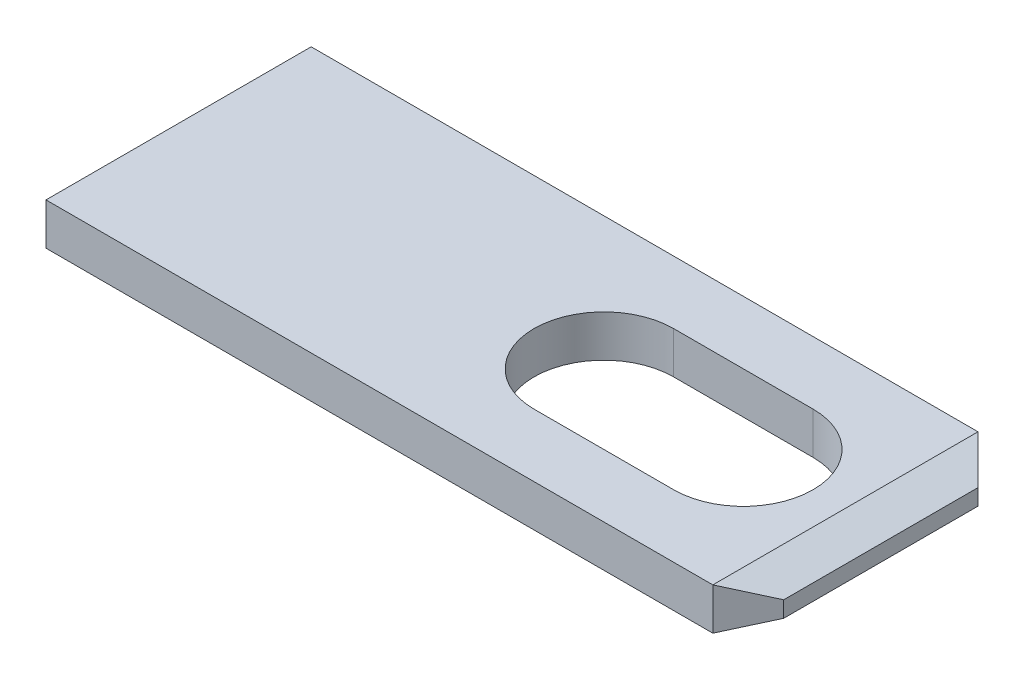
ISO-10303-21;
HEADER;
FILE_DESCRIPTION(('STEP AP214'),'2;1');
FILE_NAME('part.step','',(''),(''),'','','');
FILE_SCHEMA(('AUTOMOTIVE_DESIGN { 1 0 10303 214 1 1 1 1 }'));
ENDSEC;
DATA;
#1=APPLICATION_CONTEXT('core data for automotive mechanical design processes');
#2=APPLICATION_PROTOCOL_DEFINITION('international standard','automotive_design',2000,#1);
#3=PRODUCT_CONTEXT('',#1,'mechanical');
#4=PRODUCT('Part','Part','',(#3));
#5=PRODUCT_RELATED_PRODUCT_CATEGORY('part','',(#4));
#6=PRODUCT_DEFINITION_FORMATION('','',#4);
#7=PRODUCT_DEFINITION_CONTEXT('part definition',#1,'design');
#8=PRODUCT_DEFINITION('design','',#6,#7);
#9=PRODUCT_DEFINITION_SHAPE('','',#8);
#10=(LENGTH_UNIT() NAMED_UNIT(*) SI_UNIT(.MILLI.,.METRE.));
#11=(NAMED_UNIT(*) PLANE_ANGLE_UNIT() SI_UNIT($,.RADIAN.));
#12=(NAMED_UNIT(*) SI_UNIT($,.STERADIAN.) SOLID_ANGLE_UNIT());
#13=UNCERTAINTY_MEASURE_WITH_UNIT(LENGTH_MEASURE(1.E-05),#10,'distance_accuracy_value','');
#14=(GEOMETRIC_REPRESENTATION_CONTEXT(3) GLOBAL_UNCERTAINTY_ASSIGNED_CONTEXT((#13)) GLOBAL_UNIT_ASSIGNED_CONTEXT((#10,
#11,#12)) REPRESENTATION_CONTEXT('',''));
#15=CARTESIAN_POINT('',(0.,0.,0.));
#16=DIRECTION('',(0.,0.,1.));
#17=DIRECTION('',(1.,0.,0.));
#18=AXIS2_PLACEMENT_3D('',#15,#16,#17);
#19=CARTESIAN_POINT('',(10.063988,-0.115103120992769,1.89999999999998));
#20=DIRECTION('',(0.342020143325666,-0.939692620785909,0.));
#21=DIRECTION('',(0.939692620785909,0.342020143325666,0.));
#22=AXIS2_PLACEMENT_3D('',#19,#20,#21);
#23=PLANE('',#22);
#24=DIRECTION('',(-0.684791078771737,-0.249243569363954,-0.684791078771735));
#25=VECTOR('',#24,1.);
#26=CARTESIAN_POINT('',(10.063988,-0.115103120992769,-1.39200000000001));
#27=LINE('',#26,#25);
#28=CARTESIAN_POINT('',(10.063988,-0.115103120992769,-1.39200000000001));
#29=VERTEX_POINT('',#28);
#30=CARTESIAN_POINT('',(9.555988,-0.299999999999999,-1.90000000000001));
#31=VERTEX_POINT('',#30);
#32=EDGE_CURVE('E118',#29,#31,#27,.T.);
#33=ORIENTED_EDGE('',*,*,#32,.F.);
#34=DIRECTION('',(0.,0.,-1.));
#35=VECTOR('',#34,1.);
#36=CARTESIAN_POINT('',(10.063988,-0.115103120992769,1.89999999999998));
#37=LINE('',#36,#35);
#38=CARTESIAN_POINT('',(10.063988,-0.115103120992769,1.39199999999999));
#39=VERTEX_POINT('',#38);
#40=EDGE_CURVE('E142',#39,#29,#37,.T.);
#41=ORIENTED_EDGE('',*,*,#40,.F.);
#42=DIRECTION('',(0.684791078771737,0.249243569363954,-0.684791078771735));
#43=VECTOR('',#42,1.);
#44=CARTESIAN_POINT('',(9.555988,-0.3,1.89999999999999));
#45=LINE('',#44,#43);
#46=CARTESIAN_POINT('',(9.555988,-0.3,1.89999999999999));
#47=VERTEX_POINT('',#46);
#48=EDGE_CURVE('E139',#47,#39,#45,.T.);
#49=ORIENTED_EDGE('',*,*,#48,.F.);
#50=DIRECTION('',(0.,0.,1.));
#51=VECTOR('',#50,1.);
#52=CARTESIAN_POINT('',(9.555988,-0.3,-1.90000000000001));
#53=LINE('',#52,#51);
#54=EDGE_CURVE('E100',#47,#31,#53,.F.);
#55=ORIENTED_EDGE('',*,*,#54,.T.);
#56=EDGE_LOOP('',(#33,#41,#49,#55));
#57=FACE_BOUND('',#56,.T.);
#58=ADVANCED_FACE('F16',(#57),#23,.T.);
#59=CARTESIAN_POINT('',(10.063988,0.299999999999999,-1.39200000000001));
#60=DIRECTION('',(0.707106781186546,0.,-0.707106781186549));
#61=DIRECTION('',(-0.707106781186549,0.,-0.707106781186546));
#62=AXIS2_PLACEMENT_3D('',#59,#60,#61);
#63=PLANE('',#62);
#64=DIRECTION('',(0.,1.,0.));
#65=VECTOR('',#64,1.);
#66=CARTESIAN_POINT('',(9.555988,-0.3,-1.90000000000001));
#67=LINE('',#66,#65);
#68=CARTESIAN_POINT('',(9.555988,0.3,-1.90000000000001));
#69=VERTEX_POINT('',#68);
#70=EDGE_CURVE('E153',#31,#69,#67,.T.);
#71=ORIENTED_EDGE('',*,*,#70,.T.);
#72=DIRECTION('',(-0.684791078771737,0.249243569363953,-0.684791078771735));
#73=VECTOR('',#72,1.);
#74=CARTESIAN_POINT('',(10.063988,0.115103120992769,-1.39200000000001));
#75=LINE('',#74,#73);
#76=CARTESIAN_POINT('',(10.063988,0.115103120992769,-1.39200000000001));
#77=VERTEX_POINT('',#76);
#78=EDGE_CURVE('E168',#77,#69,#75,.T.);
#79=ORIENTED_EDGE('',*,*,#78,.F.);
#80=DIRECTION('',(0.,1.,0.));
#81=VECTOR('',#80,1.);
#82=CARTESIAN_POINT('',(10.063988,0.299999999999999,-1.39200000000001));
#83=LINE('',#82,#81);
#84=EDGE_CURVE('E141',#29,#77,#83,.T.);
#85=ORIENTED_EDGE('',*,*,#84,.F.);
#86=ORIENTED_EDGE('',*,*,#32,.T.);
#87=EDGE_LOOP('',(#71,#79,#85,#86));
#88=FACE_BOUND('',#87,.T.);
#89=ADVANCED_FACE('F150',(#88),#63,.T.);
#90=CARTESIAN_POINT('',(10.063988,0.299999999999999,1.89999999999998));
#91=DIRECTION('',(1.,0.,0.));
#92=DIRECTION('',(0.,0.,-1.));
#93=AXIS2_PLACEMENT_3D('',#90,#91,#92);
#94=PLANE('',#93);
#95=ORIENTED_EDGE('',*,*,#84,.T.);
#96=DIRECTION('',(0.,0.,1.));
#97=VECTOR('',#96,1.);
#98=CARTESIAN_POINT('',(10.063988,0.115103120992768,1.89999999999998));
#99=LINE('',#98,#97);
#100=CARTESIAN_POINT('',(10.063988,0.115103120992769,1.39199999999999));
#101=VERTEX_POINT('',#100);
#102=EDGE_CURVE('E179',#101,#77,#99,.F.);
#103=ORIENTED_EDGE('',*,*,#102,.F.);
#104=DIRECTION('',(0.,1.,0.));
#105=VECTOR('',#104,1.);
#106=CARTESIAN_POINT('',(10.063988,0.299999999999999,1.39199999999999));
#107=LINE('',#106,#105);
#108=EDGE_CURVE('E137',#39,#101,#107,.T.);
#109=ORIENTED_EDGE('',*,*,#108,.F.);
#110=ORIENTED_EDGE('',*,*,#40,.T.);
#111=EDGE_LOOP('',(#95,#103,#109,#110));
#112=FACE_BOUND('',#111,.T.);
#113=ADVANCED_FACE('F298',(#112),#94,.T.);
#114=CARTESIAN_POINT('',(10.063988,0.299999999999999,1.39199999999999));
#115=DIRECTION('',(0.707106781186546,0.,0.707106781186549));
#116=DIRECTION('',(0.707106781186549,0.,-0.707106781186546));
#117=AXIS2_PLACEMENT_3D('',#114,#115,#116);
#118=PLANE('',#117);
#119=ORIENTED_EDGE('',*,*,#108,.T.);
#120=DIRECTION('',(0.684791078771738,-0.249243569363953,-0.684791078771735));
#121=VECTOR('',#120,1.);
#122=CARTESIAN_POINT('',(9.555988,0.299999999999998,1.89999999999998));
#123=LINE('',#122,#121);
#124=CARTESIAN_POINT('',(9.555988,0.299999999999999,1.89999999999999));
#125=VERTEX_POINT('',#124);
#126=EDGE_CURVE('E176',#125,#101,#123,.T.);
#127=ORIENTED_EDGE('',*,*,#126,.F.);
#128=DIRECTION('',(0.,1.,0.));
#129=VECTOR('',#128,1.);
#130=CARTESIAN_POINT('',(9.555988,-0.3,1.89999999999998));
#131=LINE('',#130,#129);
#132=EDGE_CURVE('E33',#125,#47,#131,.F.);
#133=ORIENTED_EDGE('',*,*,#132,.T.);
#134=ORIENTED_EDGE('',*,*,#48,.T.);
#135=EDGE_LOOP('',(#119,#127,#133,#134));
#136=FACE_BOUND('',#135,.T.);
#137=ADVANCED_FACE('F290',(#136),#118,.T.);
#138=CARTESIAN_POINT('',(10.063988,-0.3,-1.90000000000001));
#139=DIRECTION('',(0.,1.,0.));
#140=DIRECTION('',(0.,0.,1.));
#141=AXIS2_PLACEMENT_3D('',#138,#139,#140);
#142=PLANE('',#141);
#143=ORIENTED_EDGE('',*,*,#54,.F.);
#144=DIRECTION('',(-1.,0.,0.));
#145=VECTOR('',#144,1.);
#146=CARTESIAN_POINT('',(10.063988,-0.3,1.89999999999998));
#147=LINE('',#146,#145);
#148=CARTESIAN_POINT('',(0.,-0.3,1.89999999999999));
#149=VERTEX_POINT('',#148);
#150=EDGE_CURVE('E128',#47,#149,#147,.T.);
#151=ORIENTED_EDGE('',*,*,#150,.T.);
#152=DIRECTION('',(0.,0.,-1.));
#153=VECTOR('',#152,1.);
#154=CARTESIAN_POINT('',(0.,-0.3,1.89999999999998));
#155=LINE('',#154,#153);
#156=CARTESIAN_POINT('',(0.,-0.3,-1.90000000000001));
#157=VERTEX_POINT('',#156);
#158=EDGE_CURVE('E108',#149,#157,#155,.T.);
#159=ORIENTED_EDGE('',*,*,#158,.T.);
#160=DIRECTION('',(1.,0.,0.));
#161=VECTOR('',#160,1.);
#162=CARTESIAN_POINT('',(10.063988,-0.3,-1.90000000000001));
#163=LINE('',#162,#161);
#164=EDGE_CURVE('E164',#157,#31,#163,.T.);
#165=ORIENTED_EDGE('',*,*,#164,.T.);
#166=EDGE_LOOP('',(#143,#151,#159,#165));
#167=FACE_BOUND('',#166,.T.);
#168=CARTESIAN_POINT('',(6.09373158605447,-0.300000000000001,0.));
#169=DIRECTION('',(0.,1.,0.));
#170=DIRECTION('',(0.,0.,1.));
#171=AXIS2_PLACEMENT_3D('',#168,#169,#170);
#172=CIRCLE('',#171,1.);
#173=CARTESIAN_POINT('',(6.09373158605447,-0.300000000000001,-1.));
#174=VERTEX_POINT('',#173);
#175=CARTESIAN_POINT('',(6.09373158605447,-0.300000000000001,1.));
#176=VERTEX_POINT('',#175);
#177=EDGE_CURVE('E112',#174,#176,#172,.T.);
#178=ORIENTED_EDGE('',*,*,#177,.T.);
#179=DIRECTION('',(1.,0.,0.));
#180=VECTOR('',#179,1.);
#181=CARTESIAN_POINT('',(8.09373158605447,-0.300000000000001,1.));
#182=LINE('',#181,#180);
#183=CARTESIAN_POINT('',(8.09373158605447,-0.300000000000001,1.));
#184=VERTEX_POINT('',#183);
#185=EDGE_CURVE('E104',#176,#184,#182,.T.);
#186=ORIENTED_EDGE('',*,*,#185,.T.);
#187=CARTESIAN_POINT('',(8.09373158605447,-0.3,0.));
#188=DIRECTION('',(0.,1.,0.));
#189=DIRECTION('',(0.,0.,1.));
#190=AXIS2_PLACEMENT_3D('',#187,#188,#189);
#191=CIRCLE('',#190,1.);
#192=CARTESIAN_POINT('',(8.09373158605447,-0.3,-1.));
#193=VERTEX_POINT('',#192);
#194=EDGE_CURVE('E19',#184,#193,#191,.T.);
#195=ORIENTED_EDGE('',*,*,#194,.T.);
#196=DIRECTION('',(1.,0.,0.));
#197=VECTOR('',#196,1.);
#198=CARTESIAN_POINT('',(6.09373158605447,-0.300000000000001,-1.));
#199=LINE('',#198,#197);
#200=EDGE_CURVE('E120',#193,#174,#199,.F.);
#201=ORIENTED_EDGE('',*,*,#200,.T.);
#202=EDGE_LOOP('',(#178,#186,#195,#201));
#203=FACE_BOUND('',#202,.T.);
#204=ADVANCED_FACE('F110',(#167,#203),#142,.F.);
#205=CARTESIAN_POINT('',(8.09373158605447,-0.300000000000001,0.));
#206=DIRECTION('',(0.,1.,0.));
#207=DIRECTION('',(0.,0.,1.));
#208=AXIS2_PLACEMENT_3D('',#205,#206,#207);
#209=CYLINDRICAL_SURFACE('',#208,1.);
#210=DIRECTION('',(0.,1.,0.));
#211=VECTOR('',#210,1.);
#212=CARTESIAN_POINT('',(8.09373158605447,-0.300000000000001,-1.));
#213=LINE('',#212,#211);
#214=CARTESIAN_POINT('',(8.09373158605447,0.3,-1.));
#215=VERTEX_POINT('',#214);
#216=EDGE_CURVE('E96',#215,#193,#213,.F.);
#217=ORIENTED_EDGE('',*,*,#216,.T.);
#218=ORIENTED_EDGE('',*,*,#194,.F.);
#219=DIRECTION('',(0.,-1.,0.));
#220=VECTOR('',#219,1.);
#221=CARTESIAN_POINT('',(8.09373158605447,-0.300000000000001,1.));
#222=LINE('',#221,#220);
#223=CARTESIAN_POINT('',(8.09373158605447,0.3,1.));
#224=VERTEX_POINT('',#223);
#225=EDGE_CURVE('E94',#184,#224,#222,.F.);
#226=ORIENTED_EDGE('',*,*,#225,.T.);
#227=CARTESIAN_POINT('',(8.09373158605447,0.3,0.));
#228=DIRECTION('',(0.,1.,0.));
#229=DIRECTION('',(0.,0.,1.));
#230=AXIS2_PLACEMENT_3D('',#227,#228,#229);
#231=CIRCLE('',#230,1.);
#232=EDGE_CURVE('E127',#224,#215,#231,.T.);
#233=ORIENTED_EDGE('',*,*,#232,.T.);
#234=EDGE_LOOP('',(#217,#218,#226,#233));
#235=FACE_BOUND('',#234,.T.);
#236=ADVANCED_FACE('F92',(#235),#209,.F.);
#237=CARTESIAN_POINT('',(6.09373158605447,-0.300000000000001,-1.));
#238=DIRECTION('',(0.,0.,-1.));
#239=DIRECTION('',(0.,1.,0.));
#240=AXIS2_PLACEMENT_3D('',#237,#238,#239);
#241=PLANE('',#240);
#242=DIRECTION('',(0.,1.,0.));
#243=VECTOR('',#242,1.);
#244=CARTESIAN_POINT('',(6.09373158605447,-0.300000000000001,-1.));
#245=LINE('',#244,#243);
#246=CARTESIAN_POINT('',(6.09373158605447,0.3,-1.));
#247=VERTEX_POINT('',#246);
#248=EDGE_CURVE('E122',#247,#174,#245,.F.);
#249=ORIENTED_EDGE('',*,*,#248,.T.);
#250=ORIENTED_EDGE('',*,*,#200,.F.);
#251=ORIENTED_EDGE('',*,*,#216,.F.);
#252=DIRECTION('',(1.,0.,0.));
#253=VECTOR('',#252,1.);
#254=CARTESIAN_POINT('',(10.063988,0.3,-1.));
#255=LINE('',#254,#253);
#256=EDGE_CURVE('E126',#215,#247,#255,.F.);
#257=ORIENTED_EDGE('',*,*,#256,.T.);
#258=EDGE_LOOP('',(#249,#250,#251,#257));
#259=FACE_BOUND('',#258,.T.);
#260=ADVANCED_FACE('F267',(#259),#241,.F.);
#261=CARTESIAN_POINT('',(6.09373158605447,-0.300000000000001,0.));
#262=DIRECTION('',(0.,1.,0.));
#263=DIRECTION('',(0.,0.,1.));
#264=AXIS2_PLACEMENT_3D('',#261,#262,#263);
#265=CYLINDRICAL_SURFACE('',#264,1.);
#266=DIRECTION('',(0.,-1.,0.));
#267=VECTOR('',#266,1.);
#268=CARTESIAN_POINT('',(6.09373158605447,-0.300000000000001,1.));
#269=LINE('',#268,#267);
#270=CARTESIAN_POINT('',(6.09373158605447,0.3,1.));
#271=VERTEX_POINT('',#270);
#272=EDGE_CURVE('E113',#271,#176,#269,.T.);
#273=ORIENTED_EDGE('',*,*,#272,.T.);
#274=ORIENTED_EDGE('',*,*,#177,.F.);
#275=ORIENTED_EDGE('',*,*,#248,.F.);
#276=CARTESIAN_POINT('',(6.09373158605447,0.3,0.));
#277=DIRECTION('',(0.,1.,0.));
#278=DIRECTION('',(0.,0.,1.));
#279=AXIS2_PLACEMENT_3D('',#276,#277,#278);
#280=CIRCLE('',#279,1.);
#281=EDGE_CURVE('E123',#247,#271,#280,.T.);
#282=ORIENTED_EDGE('',*,*,#281,.T.);
#283=EDGE_LOOP('',(#273,#274,#275,#282));
#284=FACE_BOUND('',#283,.T.);
#285=ADVANCED_FACE('F213',(#284),#265,.F.);
#286=CARTESIAN_POINT('',(8.09373158605447,-0.300000000000001,1.));
#287=DIRECTION('',(0.,0.,1.));
#288=DIRECTION('',(0.,-1.,0.));
#289=AXIS2_PLACEMENT_3D('',#286,#287,#288);
#290=PLANE('',#289);
#291=ORIENTED_EDGE('',*,*,#225,.F.);
#292=ORIENTED_EDGE('',*,*,#185,.F.);
#293=ORIENTED_EDGE('',*,*,#272,.F.);
#294=DIRECTION('',(1.,0.,0.));
#295=VECTOR('',#294,1.);
#296=CARTESIAN_POINT('',(10.063988,0.3,1.));
#297=LINE('',#296,#295);
#298=EDGE_CURVE('E107',#271,#224,#297,.T.);
#299=ORIENTED_EDGE('',*,*,#298,.T.);
#300=EDGE_LOOP('',(#291,#292,#293,#299));
#301=FACE_BOUND('',#300,.T.);
#302=ADVANCED_FACE('F103',(#301),#290,.F.);
#303=CARTESIAN_POINT('',(0.,0.299999999999999,1.89999999999998));
#304=DIRECTION('',(1.,0.,0.));
#305=DIRECTION('',(0.,0.,-1.));
#306=AXIS2_PLACEMENT_3D('',#303,#304,#305);
#307=PLANE('',#306);
#308=DIRECTION('',(0.,0.,-1.));
#309=VECTOR('',#308,1.);
#310=CARTESIAN_POINT('',(0.,0.3,-1.90000000000001));
#311=LINE('',#310,#309);
#312=CARTESIAN_POINT('',(0.,0.3,1.89999999999999));
#313=VERTEX_POINT('',#312);
#314=CARTESIAN_POINT('',(0.,0.3,-1.90000000000001));
#315=VERTEX_POINT('',#314);
#316=EDGE_CURVE('E189',#313,#315,#311,.T.);
#317=ORIENTED_EDGE('',*,*,#316,.T.);
#318=DIRECTION('',(0.,1.,0.));
#319=VECTOR('',#318,1.);
#320=CARTESIAN_POINT('',(0.,-0.3,-1.90000000000001));
#321=LINE('',#320,#319);
#322=EDGE_CURVE('E170',#315,#157,#321,.F.);
#323=ORIENTED_EDGE('',*,*,#322,.T.);
#324=ORIENTED_EDGE('',*,*,#158,.F.);
#325=DIRECTION('',(0.,1.,0.));
#326=VECTOR('',#325,1.);
#327=CARTESIAN_POINT('',(0.,-0.3,1.89999999999998));
#328=LINE('',#327,#326);
#329=EDGE_CURVE('E182',#149,#313,#328,.T.);
#330=ORIENTED_EDGE('',*,*,#329,.T.);
#331=EDGE_LOOP('',(#317,#323,#324,#330));
#332=FACE_BOUND('',#331,.T.);
#333=ADVANCED_FACE('F204',(#332),#307,.F.);
#334=CARTESIAN_POINT('',(10.063988,-0.3,-1.90000000000001));
#335=DIRECTION('',(0.,0.,1.));
#336=DIRECTION('',(1.,0.,0.));
#337=AXIS2_PLACEMENT_3D('',#334,#335,#336);
#338=PLANE('',#337);
#339=ORIENTED_EDGE('',*,*,#70,.F.);
#340=ORIENTED_EDGE('',*,*,#164,.F.);
#341=ORIENTED_EDGE('',*,*,#322,.F.);
#342=DIRECTION('',(1.,0.,0.));
#343=VECTOR('',#342,1.);
#344=CARTESIAN_POINT('',(10.063988,0.3,-1.90000000000001));
#345=LINE('',#344,#343);
#346=EDGE_CURVE('E167',#315,#69,#345,.T.);
#347=ORIENTED_EDGE('',*,*,#346,.T.);
#348=EDGE_LOOP('',(#339,#340,#341,#347));
#349=FACE_BOUND('',#348,.T.);
#350=ADVANCED_FACE('F163',(#349),#338,.F.);
#351=CARTESIAN_POINT('',(10.063988,0.115103120992768,1.89999999999998));
#352=DIRECTION('',(0.342020143325666,0.939692620785909,0.));
#353=DIRECTION('',(-0.939692620785909,0.342020143325666,0.));
#354=AXIS2_PLACEMENT_3D('',#351,#352,#353);
#355=PLANE('',#354);
#356=ORIENTED_EDGE('',*,*,#126,.T.);
#357=ORIENTED_EDGE('',*,*,#102,.T.);
#358=ORIENTED_EDGE('',*,*,#78,.T.);
#359=DIRECTION('',(0.,0.,-1.));
#360=VECTOR('',#359,1.);
#361=CARTESIAN_POINT('',(9.555988,0.3,-1.90000000000001));
#362=LINE('',#361,#360);
#363=EDGE_CURVE('E25',#69,#125,#362,.F.);
#364=ORIENTED_EDGE('',*,*,#363,.T.);
#365=EDGE_LOOP('',(#356,#357,#358,#364));
#366=FACE_BOUND('',#365,.T.);
#367=ADVANCED_FACE('F195',(#366),#355,.T.);
#368=CARTESIAN_POINT('',(10.063988,-0.3,1.89999999999998));
#369=DIRECTION('',(0.,0.,-1.));
#370=DIRECTION('',(-1.,0.,0.));
#371=AXIS2_PLACEMENT_3D('',#368,#369,#370);
#372=PLANE('',#371);
#373=ORIENTED_EDGE('',*,*,#132,.F.);
#374=DIRECTION('',(1.,0.,0.));
#375=VECTOR('',#374,1.);
#376=CARTESIAN_POINT('',(10.063988,0.299999999999999,1.89999999999999));
#377=LINE('',#376,#375);
#378=EDGE_CURVE('E10',#125,#313,#377,.F.);
#379=ORIENTED_EDGE('',*,*,#378,.T.);
#380=ORIENTED_EDGE('',*,*,#329,.F.);
#381=ORIENTED_EDGE('',*,*,#150,.F.);
#382=EDGE_LOOP('',(#373,#379,#380,#381));
#383=FACE_BOUND('',#382,.T.);
#384=ADVANCED_FACE('F202',(#383),#372,.F.);
#385=CARTESIAN_POINT('',(10.063988,0.3,-1.90000000000001));
#386=DIRECTION('',(0.,-1.,0.));
#387=DIRECTION('',(0.,0.,-1.));
#388=AXIS2_PLACEMENT_3D('',#385,#386,#387);
#389=PLANE('',#388);
#390=ORIENTED_EDGE('',*,*,#363,.F.);
#391=ORIENTED_EDGE('',*,*,#346,.F.);
#392=ORIENTED_EDGE('',*,*,#316,.F.);
#393=ORIENTED_EDGE('',*,*,#378,.F.);
#394=EDGE_LOOP('',(#390,#391,#392,#393));
#395=FACE_BOUND('',#394,.T.);
#396=ORIENTED_EDGE('',*,*,#281,.F.);
#397=ORIENTED_EDGE('',*,*,#256,.F.);
#398=ORIENTED_EDGE('',*,*,#232,.F.);
#399=ORIENTED_EDGE('',*,*,#298,.F.);
#400=EDGE_LOOP('',(#396,#397,#398,#399));
#401=FACE_BOUND('',#400,.T.);
#402=ADVANCED_FACE('F199',(#395,#401),#389,.F.);
#403=CLOSED_SHELL('',(#58,#89,#113,#137,#204,#236,#260,#285,#302,#333,#350,#367,#384,#402));
#404=MANIFOLD_SOLID_BREP('B1',#403);
#405=ADVANCED_BREP_SHAPE_REPRESENTATION('',(#18,#404),#14);
#406=SHAPE_DEFINITION_REPRESENTATION(#9,#405);
ENDSEC;
END-ISO-10303-21;
